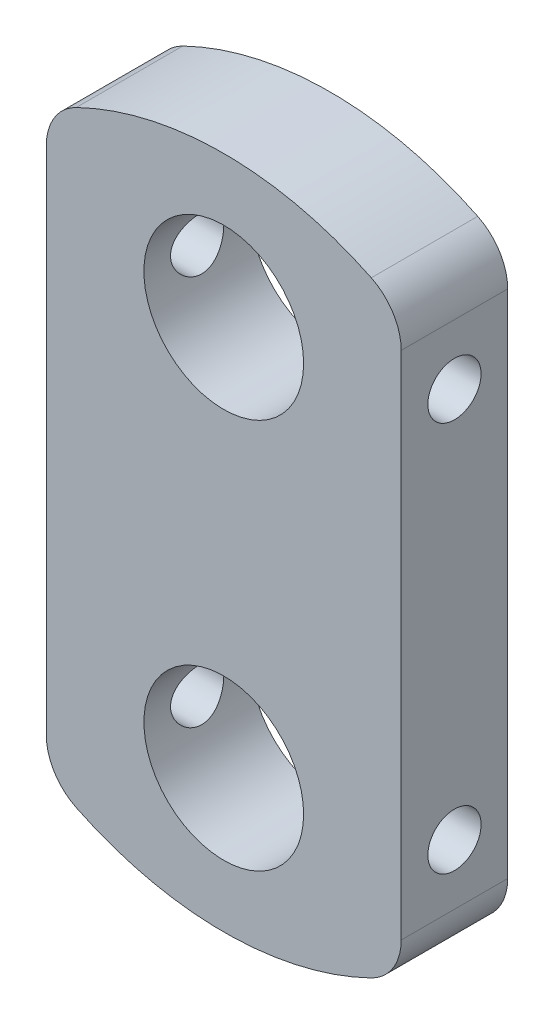
ISO-10303-21;
HEADER;
FILE_DESCRIPTION(('STEP AP214'),'2;1');
FILE_NAME('part.step','',(''),(''),'','','');
FILE_SCHEMA(('AUTOMOTIVE_DESIGN { 1 0 10303 214 1 1 1 1 }'));
ENDSEC;
DATA;
#1=APPLICATION_CONTEXT('core data for automotive mechanical design processes');
#2=APPLICATION_PROTOCOL_DEFINITION('international standard','automotive_design',2000,#1);
#3=PRODUCT_CONTEXT('',#1,'mechanical');
#4=PRODUCT('Part','Part','',(#3));
#5=PRODUCT_RELATED_PRODUCT_CATEGORY('part','',(#4));
#6=PRODUCT_DEFINITION_FORMATION('','',#4);
#7=PRODUCT_DEFINITION_CONTEXT('part definition',#1,'design');
#8=PRODUCT_DEFINITION('design','',#6,#7);
#9=PRODUCT_DEFINITION_SHAPE('','',#8);
#10=(LENGTH_UNIT() NAMED_UNIT(*) SI_UNIT(.MILLI.,.METRE.));
#11=(NAMED_UNIT(*) PLANE_ANGLE_UNIT() SI_UNIT($,.RADIAN.));
#12=(NAMED_UNIT(*) SI_UNIT($,.STERADIAN.) SOLID_ANGLE_UNIT());
#13=UNCERTAINTY_MEASURE_WITH_UNIT(LENGTH_MEASURE(1.E-05),#10,'distance_accuracy_value','');
#14=(GEOMETRIC_REPRESENTATION_CONTEXT(3) GLOBAL_UNCERTAINTY_ASSIGNED_CONTEXT((#13)) GLOBAL_UNIT_ASSIGNED_CONTEXT((#10,
#11,#12)) REPRESENTATION_CONTEXT('',''));
#15=CARTESIAN_POINT('',(0.,0.,0.));
#16=DIRECTION('',(0.,0.,1.));
#17=DIRECTION('',(1.,0.,0.));
#18=AXIS2_PLACEMENT_3D('',#15,#16,#17);
#19=CARTESIAN_POINT('',(0.,0.,6.));
#20=DIRECTION('',(0.,0.,-1.));
#21=DIRECTION('',(-1.,0.,0.));
#22=AXIS2_PLACEMENT_3D('',#19,#20,#21);
#23=CYLINDRICAL_SURFACE('',#22,19.);
#24=CARTESIAN_POINT('',(0.,0.,0.));
#25=DIRECTION('',(0.,0.,1.));
#26=DIRECTION('',(1.,0.,0.));
#27=AXIS2_PLACEMENT_3D('',#24,#25,#26);
#28=CIRCLE('',#27,19.);
#29=CARTESIAN_POINT('',(8.3125,17.0851498018016,0.));
#30=VERTEX_POINT('',#29);
#31=CARTESIAN_POINT('',(-8.3125,17.0851498018016,0.));
#32=VERTEX_POINT('',#31);
#33=EDGE_CURVE('E152',#30,#32,#28,.T.);
#34=ORIENTED_EDGE('',*,*,#33,.T.);
#35=DIRECTION('',(0.,0.,-1.));
#36=VECTOR('',#35,1.);
#37=CARTESIAN_POINT('',(-8.3125,17.0851498018016,6.));
#38=LINE('',#37,#36);
#39=CARTESIAN_POINT('',(-8.3125,17.0851498018016,6.));
#40=VERTEX_POINT('',#39);
#41=EDGE_CURVE('E11',#40,#32,#38,.T.);
#42=ORIENTED_EDGE('',*,*,#41,.F.);
#43=CARTESIAN_POINT('',(0.,0.,6.));
#44=DIRECTION('',(0.,0.,1.));
#45=DIRECTION('',(1.,0.,0.));
#46=AXIS2_PLACEMENT_3D('',#43,#44,#45);
#47=CIRCLE('',#46,19.);
#48=CARTESIAN_POINT('',(8.3125,17.0851498018016,6.));
#49=VERTEX_POINT('',#48);
#50=EDGE_CURVE('E175',#49,#40,#47,.T.);
#51=ORIENTED_EDGE('',*,*,#50,.F.);
#52=DIRECTION('',(0.,0.,-1.));
#53=VECTOR('',#52,1.);
#54=CARTESIAN_POINT('',(8.3125,17.0851498018016,6.));
#55=LINE('',#54,#53);
#56=EDGE_CURVE('E151',#49,#30,#55,.T.);
#57=ORIENTED_EDGE('',*,*,#56,.T.);
#58=EDGE_LOOP('',(#34,#42,#51,#57));
#59=FACE_BOUND('',#58,.T.);
#60=ADVANCED_FACE('F42',(#59),#23,.T.);
#61=CARTESIAN_POINT('',(-7.,14.3874945699382,6.));
#62=DIRECTION('',(0.,0.,-1.));
#63=DIRECTION('',(-1.,0.,0.));
#64=AXIS2_PLACEMENT_3D('',#61,#62,#63);
#65=CYLINDRICAL_SURFACE('',#64,3.);
#66=CARTESIAN_POINT('',(-7.,14.3874945699382,0.));
#67=DIRECTION('',(0.,0.,1.));
#68=DIRECTION('',(1.,0.,0.));
#69=AXIS2_PLACEMENT_3D('',#66,#67,#68);
#70=CIRCLE('',#69,3.);
#71=CARTESIAN_POINT('',(-10.,14.3874945699382,0.));
#72=VERTEX_POINT('',#71);
#73=EDGE_CURVE('E155',#32,#72,#70,.T.);
#74=ORIENTED_EDGE('',*,*,#73,.T.);
#75=DIRECTION('',(0.,0.,-1.));
#76=VECTOR('',#75,1.);
#77=CARTESIAN_POINT('',(-10.,14.3874945699382,6.));
#78=LINE('',#77,#76);
#79=CARTESIAN_POINT('',(-10.,14.3874945699382,6.));
#80=VERTEX_POINT('',#79);
#81=EDGE_CURVE('E56',#80,#72,#78,.T.);
#82=ORIENTED_EDGE('',*,*,#81,.F.);
#83=CARTESIAN_POINT('',(-7.,14.3874945699382,6.));
#84=DIRECTION('',(0.,0.,1.));
#85=DIRECTION('',(1.,0.,0.));
#86=AXIS2_PLACEMENT_3D('',#83,#84,#85);
#87=CIRCLE('',#86,3.);
#88=EDGE_CURVE('E108',#40,#80,#87,.T.);
#89=ORIENTED_EDGE('',*,*,#88,.F.);
#90=ORIENTED_EDGE('',*,*,#41,.T.);
#91=EDGE_LOOP('',(#74,#82,#89,#90));
#92=FACE_BOUND('',#91,.T.);
#93=ADVANCED_FACE('F220',(#92),#65,.T.);
#94=CARTESIAN_POINT('',(-10.,0.,6.));
#95=DIRECTION('',(-1.,0.,0.));
#96=DIRECTION('',(0.,0.,1.));
#97=AXIS2_PLACEMENT_3D('',#94,#95,#96);
#98=PLANE('',#97);
#99=CARTESIAN_POINT('',(-10.,11.,3.));
#100=DIRECTION('',(1.,0.,0.));
#101=DIRECTION('',(0.,0.,-1.));
#102=AXIS2_PLACEMENT_3D('',#99,#100,#101);
#103=CIRCLE('',#102,1.5);
#104=CARTESIAN_POINT('',(-10.,11.,1.5));
#105=VERTEX_POINT('',#104);
#106=EDGE_CURVE('E194',#105,#105,#103,.T.);
#107=ORIENTED_EDGE('',*,*,#106,.T.);
#108=EDGE_LOOP('',(#107));
#109=FACE_BOUND('',#108,.T.);
#110=CARTESIAN_POINT('',(-10.,-11.,3.));
#111=DIRECTION('',(1.,0.,0.));
#112=DIRECTION('',(0.,0.,-1.));
#113=AXIS2_PLACEMENT_3D('',#110,#111,#112);
#114=CIRCLE('',#113,1.5);
#115=CARTESIAN_POINT('',(-10.,-11.,1.5));
#116=VERTEX_POINT('',#115);
#117=EDGE_CURVE('E247',#116,#116,#114,.T.);
#118=ORIENTED_EDGE('',*,*,#117,.T.);
#119=EDGE_LOOP('',(#118));
#120=FACE_BOUND('',#119,.T.);
#121=DIRECTION('',(0.,1.,0.));
#122=VECTOR('',#121,1.);
#123=CARTESIAN_POINT('',(-10.,0.,0.));
#124=LINE('',#123,#122);
#125=CARTESIAN_POINT('',(-10.,-14.3874945699382,0.));
#126=VERTEX_POINT('',#125);
#127=EDGE_CURVE('E159',#126,#72,#124,.T.);
#128=ORIENTED_EDGE('',*,*,#127,.F.);
#129=DIRECTION('',(0.,0.,-1.));
#130=VECTOR('',#129,1.);
#131=CARTESIAN_POINT('',(-10.,-14.3874945699382,6.));
#132=LINE('',#131,#130);
#133=CARTESIAN_POINT('',(-10.,-14.3874945699382,6.));
#134=VERTEX_POINT('',#133);
#135=EDGE_CURVE('E182',#134,#126,#132,.T.);
#136=ORIENTED_EDGE('',*,*,#135,.F.);
#137=DIRECTION('',(0.,1.,0.));
#138=VECTOR('',#137,1.);
#139=CARTESIAN_POINT('',(-10.,0.,6.));
#140=LINE('',#139,#138);
#141=EDGE_CURVE('E233',#134,#80,#140,.T.);
#142=ORIENTED_EDGE('',*,*,#141,.T.);
#143=ORIENTED_EDGE('',*,*,#81,.T.);
#144=EDGE_LOOP('',(#128,#136,#142,#143));
#145=FACE_BOUND('',#144,.T.);
#146=ADVANCED_FACE('F225',(#109,#120,#145),#98,.T.);
#147=CARTESIAN_POINT('',(-7.,-14.3874945699382,6.));
#148=DIRECTION('',(0.,0.,-1.));
#149=DIRECTION('',(-1.,0.,0.));
#150=AXIS2_PLACEMENT_3D('',#147,#148,#149);
#151=CYLINDRICAL_SURFACE('',#150,3.);
#152=CARTESIAN_POINT('',(-7.,-14.3874945699382,0.));
#153=DIRECTION('',(0.,0.,1.));
#154=DIRECTION('',(1.,0.,0.));
#155=AXIS2_PLACEMENT_3D('',#152,#153,#154);
#156=CIRCLE('',#155,3.);
#157=CARTESIAN_POINT('',(-8.3125,-17.0851498018016,0.));
#158=VERTEX_POINT('',#157);
#159=EDGE_CURVE('E162',#126,#158,#156,.T.);
#160=ORIENTED_EDGE('',*,*,#159,.T.);
#161=DIRECTION('',(0.,0.,-1.));
#162=VECTOR('',#161,1.);
#163=CARTESIAN_POINT('',(-8.3125,-17.0851498018016,6.));
#164=LINE('',#163,#162);
#165=CARTESIAN_POINT('',(-8.3125,-17.0851498018016,6.));
#166=VERTEX_POINT('',#165);
#167=EDGE_CURVE('E179',#166,#158,#164,.T.);
#168=ORIENTED_EDGE('',*,*,#167,.F.);
#169=CARTESIAN_POINT('',(-7.,-14.3874945699382,6.));
#170=DIRECTION('',(0.,0.,1.));
#171=DIRECTION('',(1.,0.,0.));
#172=AXIS2_PLACEMENT_3D('',#169,#170,#171);
#173=CIRCLE('',#172,3.);
#174=EDGE_CURVE('E235',#134,#166,#173,.T.);
#175=ORIENTED_EDGE('',*,*,#174,.F.);
#176=ORIENTED_EDGE('',*,*,#135,.T.);
#177=EDGE_LOOP('',(#160,#168,#175,#176));
#178=FACE_BOUND('',#177,.T.);
#179=ADVANCED_FACE('F286',(#178),#151,.T.);
#180=CARTESIAN_POINT('',(0.,0.,6.));
#181=DIRECTION('',(0.,0.,-1.));
#182=DIRECTION('',(-1.,0.,0.));
#183=AXIS2_PLACEMENT_3D('',#180,#181,#182);
#184=CYLINDRICAL_SURFACE('',#183,19.);
#185=CARTESIAN_POINT('',(0.,0.,0.));
#186=DIRECTION('',(0.,0.,1.));
#187=DIRECTION('',(1.,0.,0.));
#188=AXIS2_PLACEMENT_3D('',#185,#186,#187);
#189=CIRCLE('',#188,19.);
#190=CARTESIAN_POINT('',(8.3125,-17.0851498018016,0.));
#191=VERTEX_POINT('',#190);
#192=EDGE_CURVE('E164',#158,#191,#189,.T.);
#193=ORIENTED_EDGE('',*,*,#192,.T.);
#194=DIRECTION('',(0.,0.,-1.));
#195=VECTOR('',#194,1.);
#196=CARTESIAN_POINT('',(8.3125,-17.0851498018016,6.));
#197=LINE('',#196,#195);
#198=CARTESIAN_POINT('',(8.3125,-17.0851498018016,6.));
#199=VERTEX_POINT('',#198);
#200=EDGE_CURVE('E137',#199,#191,#197,.T.);
#201=ORIENTED_EDGE('',*,*,#200,.F.);
#202=CARTESIAN_POINT('',(0.,0.,6.));
#203=DIRECTION('',(0.,0.,1.));
#204=DIRECTION('',(1.,0.,0.));
#205=AXIS2_PLACEMENT_3D('',#202,#203,#204);
#206=CIRCLE('',#205,19.);
#207=EDGE_CURVE('E128',#166,#199,#206,.T.);
#208=ORIENTED_EDGE('',*,*,#207,.F.);
#209=ORIENTED_EDGE('',*,*,#167,.T.);
#210=EDGE_LOOP('',(#193,#201,#208,#209));
#211=FACE_BOUND('',#210,.T.);
#212=ADVANCED_FACE('F283',(#211),#184,.T.);
#213=CARTESIAN_POINT('',(7.,-14.3874945699382,6.));
#214=DIRECTION('',(0.,0.,-1.));
#215=DIRECTION('',(-1.,0.,0.));
#216=AXIS2_PLACEMENT_3D('',#213,#214,#215);
#217=CYLINDRICAL_SURFACE('',#216,3.);
#218=CARTESIAN_POINT('',(7.,-14.3874945699382,0.));
#219=DIRECTION('',(0.,0.,1.));
#220=DIRECTION('',(1.,0.,0.));
#221=AXIS2_PLACEMENT_3D('',#218,#219,#220);
#222=CIRCLE('',#221,3.);
#223=CARTESIAN_POINT('',(10.,-14.3874945699382,0.));
#224=VERTEX_POINT('',#223);
#225=EDGE_CURVE('E136',#191,#224,#222,.T.);
#226=ORIENTED_EDGE('',*,*,#225,.T.);
#227=DIRECTION('',(0.,0.,-1.));
#228=VECTOR('',#227,1.);
#229=CARTESIAN_POINT('',(10.,-14.3874945699382,6.));
#230=LINE('',#229,#228);
#231=CARTESIAN_POINT('',(10.,-14.3874945699382,6.));
#232=VERTEX_POINT('',#231);
#233=EDGE_CURVE('E133',#232,#224,#230,.T.);
#234=ORIENTED_EDGE('',*,*,#233,.F.);
#235=CARTESIAN_POINT('',(7.,-14.3874945699382,6.));
#236=DIRECTION('',(0.,0.,1.));
#237=DIRECTION('',(1.,0.,0.));
#238=AXIS2_PLACEMENT_3D('',#235,#236,#237);
#239=CIRCLE('',#238,3.);
#240=EDGE_CURVE('E121',#199,#232,#239,.T.);
#241=ORIENTED_EDGE('',*,*,#240,.F.);
#242=ORIENTED_EDGE('',*,*,#200,.T.);
#243=EDGE_LOOP('',(#226,#234,#241,#242));
#244=FACE_BOUND('',#243,.T.);
#245=ADVANCED_FACE('F134',(#244),#217,.T.);
#246=CARTESIAN_POINT('',(10.,0.,6.));
#247=DIRECTION('',(-1.,0.,0.));
#248=DIRECTION('',(0.,0.,1.));
#249=AXIS2_PLACEMENT_3D('',#246,#247,#248);
#250=PLANE('',#249);
#251=CARTESIAN_POINT('',(10.,11.,3.));
#252=DIRECTION('',(-1.,0.,0.));
#253=DIRECTION('',(0.,0.,1.));
#254=AXIS2_PLACEMENT_3D('',#251,#252,#253);
#255=CIRCLE('',#254,1.5);
#256=CARTESIAN_POINT('',(10.,11.,4.5));
#257=VERTEX_POINT('',#256);
#258=EDGE_CURVE('E156',#257,#257,#255,.T.);
#259=ORIENTED_EDGE('',*,*,#258,.T.);
#260=EDGE_LOOP('',(#259));
#261=FACE_BOUND('',#260,.T.);
#262=CARTESIAN_POINT('',(10.,-11.,3.));
#263=DIRECTION('',(-1.,0.,0.));
#264=DIRECTION('',(0.,0.,1.));
#265=AXIS2_PLACEMENT_3D('',#262,#263,#264);
#266=CIRCLE('',#265,1.5);
#267=CARTESIAN_POINT('',(10.,-11.,4.5));
#268=VERTEX_POINT('',#267);
#269=EDGE_CURVE('E243',#268,#268,#266,.T.);
#270=ORIENTED_EDGE('',*,*,#269,.T.);
#271=EDGE_LOOP('',(#270));
#272=FACE_BOUND('',#271,.T.);
#273=DIRECTION('',(0.,1.,0.));
#274=VECTOR('',#273,1.);
#275=CARTESIAN_POINT('',(10.,0.,0.));
#276=LINE('',#275,#274);
#277=CARTESIAN_POINT('',(10.,14.3874945699382,0.));
#278=VERTEX_POINT('',#277);
#279=EDGE_CURVE('E94',#224,#278,#276,.T.);
#280=ORIENTED_EDGE('',*,*,#279,.T.);
#281=DIRECTION('',(0.,0.,-1.));
#282=VECTOR('',#281,1.);
#283=CARTESIAN_POINT('',(10.,14.3874945699382,6.));
#284=LINE('',#283,#282);
#285=CARTESIAN_POINT('',(10.,14.3874945699382,6.));
#286=VERTEX_POINT('',#285);
#287=EDGE_CURVE('E138',#286,#278,#284,.T.);
#288=ORIENTED_EDGE('',*,*,#287,.F.);
#289=DIRECTION('',(0.,1.,0.));
#290=VECTOR('',#289,1.);
#291=CARTESIAN_POINT('',(10.,0.,6.));
#292=LINE('',#291,#290);
#293=EDGE_CURVE('E126',#232,#286,#292,.T.);
#294=ORIENTED_EDGE('',*,*,#293,.F.);
#295=ORIENTED_EDGE('',*,*,#233,.T.);
#296=EDGE_LOOP('',(#280,#288,#294,#295));
#297=FACE_BOUND('',#296,.T.);
#298=ADVANCED_FACE('F140',(#261,#272,#297),#250,.F.);
#299=CARTESIAN_POINT('',(0.,11.,6.));
#300=DIRECTION('',(0.,0.,-1.));
#301=DIRECTION('',(-1.,0.,0.));
#302=AXIS2_PLACEMENT_3D('',#299,#300,#301);
#303=CYLINDRICAL_SURFACE('',#302,4.5);
#304=CARTESIAN_POINT('',(-4.5,11.,4.5));
#305=CARTESIAN_POINT('',(-4.50000022951416,10.9181549556699,4.50000038059746));
#306=CARTESIAN_POINT('',(-4.49774654261317,10.8363122081922,4.49327960080917));
#307=CARTESIAN_POINT('',(-4.48897815304921,10.6750373586905,4.46665633677417));
#308=CARTESIAN_POINT('',(-4.48246300803229,10.5956055078218,4.44675248407662));
#309=CARTESIAN_POINT('',(-4.46587961859664,10.4415008157473,4.39452113492393));
#310=CARTESIAN_POINT('',(-4.4558173159628,10.366820261171,4.36221440631109));
#311=CARTESIAN_POINT('',(-4.43316668576013,10.223937594792,4.28618824074248));
#312=CARTESIAN_POINT('',(-4.42057786001667,10.1557367645619,4.2424665524961));
#313=CARTESIAN_POINT('',(-4.39371141664507,10.0253874874666,4.14326129271187));
#314=CARTESIAN_POINT('',(-4.37939334695677,9.96349444955254,4.08745314860926));
#315=CARTESIAN_POINT('',(-4.35090472174682,9.84975096094687,3.96634926794015));
#316=CARTESIAN_POINT('',(-4.33673419935824,9.79790272176581,3.90105144760723));
#317=CARTESIAN_POINT('',(-4.30969998715911,9.70426258665821,3.76052232720531));
#318=CARTESIAN_POINT('',(-4.29688558913532,9.66280271266845,3.68505939040182));
#319=CARTESIAN_POINT('',(-4.27462958127902,9.59327168918342,3.52773585831218));
#320=CARTESIAN_POINT('',(-4.26518694241118,9.56519645391985,3.44587722425589));
#321=CARTESIAN_POINT('',(-4.25116954904066,9.52418980773625,3.28099016775494));
#322=CARTESIAN_POINT('',(-4.24644143654417,9.51077982759235,3.1980941872664));
#323=CARTESIAN_POINT('',(-4.24193484944261,9.49798831499828,3.03110436876618));
#324=CARTESIAN_POINT('',(-4.24215484534095,9.49860244759292,2.94701090893622));
#325=CARTESIAN_POINT('',(-4.2473852251227,9.51347014444487,2.78409505433397));
#326=CARTESIAN_POINT('',(-4.25217623801299,9.52709913024951,2.70520739562147));
#327=CARTESIAN_POINT('',(-4.26564986586826,9.56659075572587,2.55090987058975));
#328=CARTESIAN_POINT('',(-4.27433294676161,9.59245486011219,2.4755004218474));
#329=CARTESIAN_POINT('',(-4.29476866696873,9.65609141290968,2.32888087561278));
#330=CARTESIAN_POINT('',(-4.30656848689676,9.69404892693911,2.25775796179571));
#331=CARTESIAN_POINT('',(-4.3318883786359,9.78066634054529,2.12269363758041));
#332=CARTESIAN_POINT('',(-4.34540894685695,9.82932933145399,2.05875430959993));
#333=CARTESIAN_POINT('',(-4.37350993751611,9.93897600097664,1.93636260275884));
#334=CARTESIAN_POINT('',(-4.38810884032264,10.0004702748855,1.8783709582364));
#335=CARTESIAN_POINT('',(-4.41610407580555,10.1324906450449,1.7734031000049));
#336=CARTESIAN_POINT('',(-4.42950029307101,10.2030176065088,1.72642794275326));
#337=CARTESIAN_POINT('',(-4.4537566190669,10.3520785804306,1.6444555496474));
#338=CARTESIAN_POINT('',(-4.46459025012059,10.4306850853755,1.6095817629889));
#339=CARTESIAN_POINT('',(-4.48230850716652,10.5930963749532,1.55369523906643));
#340=CARTESIAN_POINT('',(-4.48919450482319,10.6768993427676,1.53267768686484));
#341=CARTESIAN_POINT('',(-4.49801440607161,10.843424255706,1.50591650096646));
#342=CARTESIAN_POINT('',(-4.50015002750592,10.9260356002027,1.49955028624087));
#343=CARTESIAN_POINT('',(-4.49983354042241,11.0911626049404,1.5004990103977));
#344=CARTESIAN_POINT('',(-4.49738220629043,11.1736782789795,1.50781163996981));
#345=CARTESIAN_POINT('',(-4.48830037075656,11.3337797994564,1.53541786160394));
#346=CARTESIAN_POINT('',(-4.48179298066788,11.4114392102523,1.55532930907424));
#347=CARTESIAN_POINT('',(-4.46537770245105,11.5622839378694,1.60709016670009));
#348=CARTESIAN_POINT('',(-4.45546938070013,11.6354686827629,1.63894109920168));
#349=CARTESIAN_POINT('',(-4.43293396930935,11.7774324445899,1.71460564776118));
#350=CARTESIAN_POINT('',(-4.42024222133679,11.8460449388257,1.75871188992476));
#351=CARTESIAN_POINT('',(-4.39357880874394,11.9750972452034,1.85729122502022));
#352=CARTESIAN_POINT('',(-4.37960675390741,12.0355345516934,1.91176748404765));
#353=CARTESIAN_POINT('',(-4.35115271970667,12.1493787617094,2.03246812650988));
#354=CARTESIAN_POINT('',(-4.33667641631142,12.2023414538687,2.09911384039029));
#355=CARTESIAN_POINT('',(-4.30949959942063,12.2963862834854,2.24065735171633));
#356=CARTESIAN_POINT('',(-4.29679910073003,12.3374683218965,2.31555521795111));
#357=CARTESIAN_POINT('',(-4.27473587687075,12.4063953956245,2.47150952293484));
#358=CARTESIAN_POINT('',(-4.26536641189468,12.4342671982475,2.55255311875315));
#359=CARTESIAN_POINT('',(-4.25116248459674,12.475842000139,2.71856797506619));
#360=CARTESIAN_POINT('',(-4.24632597935459,12.4895513824309,2.80353744810652));
#361=CARTESIAN_POINT('',(-4.24196788311266,12.501914423716,2.97029564406137));
#362=CARTESIAN_POINT('',(-4.24218600386123,12.5013053859626,3.05202351043023));
#363=CARTESIAN_POINT('',(-4.24726904735801,12.486863440173,3.21414761238309));
#364=CARTESIAN_POINT('',(-4.25213369354042,12.4730313191879,3.29454392693263));
#365=CARTESIAN_POINT('',(-4.26576786457337,12.433057719694,3.45020349450371));
#366=CARTESIAN_POINT('',(-4.27446147033716,12.4071550190233,3.52553523750674));
#367=CARTESIAN_POINT('',(-4.29474598227703,12.3439690486396,3.6708411104074));
#368=CARTESIAN_POINT('',(-4.3063375314509,12.3066832528307,3.74081404678201));
#369=CARTESIAN_POINT('',(-4.33174243839069,12.2198910388751,3.87672550488437));
#370=CARTESIAN_POINT('',(-4.34563067463206,12.1699223641469,3.94235475284758));
#371=CARTESIAN_POINT('',(-4.37375034424879,12.0599643247035,4.0645347200763));
#372=CARTESIAN_POINT('',(-4.38798187368558,11.9999721266772,4.12108286353211));
#373=CARTESIAN_POINT('',(-4.41585045788316,11.868862335381,4.22571661843377));
#374=CARTESIAN_POINT('',(-4.42944272701885,11.7974022702496,4.2733865216265));
#375=CARTESIAN_POINT('',(-4.45388986758918,11.6470360361099,4.35598564327597));
#376=CARTESIAN_POINT('',(-4.46474543861895,11.5681317771985,4.39091811888306));
#377=CARTESIAN_POINT('',(-4.48208272602813,11.4087404708015,4.44558244873301));
#378=CARTESIAN_POINT('',(-4.48873818633784,11.3284816365146,4.46592369939506));
#379=CARTESIAN_POINT('',(-4.49769610596333,11.1654806240154,4.49313042101569));
#380=CARTESIAN_POINT('',(-4.49999976797857,11.0827391383531,4.49999961524481));
#381=CARTESIAN_POINT('',(-4.5,11.,4.5));
#382=B_SPLINE_CURVE_WITH_KNOTS('',3,(#304,#305,#306,#307,#308,#309,#310,#311,#312,#313,#314,
#315,#316,#317,#318,#319,#320,#321,#322,#323,#324,#325,#326,#327,#328,#329,#330,#331,#332,#333,
#334,#335,#336,#337,#338,#339,#340,#341,#342,#343,#344,#345,#346,#347,#348,#349,#350,#351,#352,
#353,#354,#355,#356,#357,#358,#359,#360,#361,#362,#363,#364,#365,#366,#367,#368,#369,#370,#371,
#372,#373,#374,#375,#376,#377,#378,#379,#380,#381),.UNSPECIFIED.,.T.,.F.,(4,2,2,2,2,2,2,2,2,2,2,
2,2,2,2,2,2,2,2,2,2,2,2,2,2,2,2,2,2,2,2,2,2,2,2,2,2,2,4),(0.,0.245230659039017,0.49048677790128,
0.73533400930541,0.980229566698647,1.23277026424134,1.48536649931295,1.74522577235205,
2.0050056703925,2.2560288861276,2.50697450981228,2.7464523982692,2.98595896283223,
3.22932256732696,3.47275653837311,3.7288995871705,3.98506718949927,4.24377608475536,
4.50239503315812,4.74980374762754,4.99717069746265,5.2373723696732,5.47760467926156,
5.72415599765605,5.97078271232837,6.22861534321128,6.48645012352495,6.74376020740156,
7.0009542705876,7.24493499096387,7.48890119027063,7.72823380620626,7.96761957263966,
8.21745100037707,8.46735316685668,8.72699491252651,8.98657021728684,9.2345483756072,
9.4824579905721),.UNSPECIFIED.);
#383=CARTESIAN_POINT('',(-4.5,11.,4.5));
#384=VERTEX_POINT('',#383);
#385=EDGE_CURVE('E45',#384,#384,#382,.T.);
#386=ORIENTED_EDGE('',*,*,#385,.F.);
#387=EDGE_LOOP('',(#386));
#388=FACE_BOUND('',#387,.T.);
#389=CARTESIAN_POINT('',(4.5,11.,1.5));
#390=CARTESIAN_POINT('',(4.50000022951416,10.9181549556699,1.49999961940254));
#391=CARTESIAN_POINT('',(4.49774654261317,10.8363122081922,1.50672039919083));
#392=CARTESIAN_POINT('',(4.48897815304921,10.6750373586905,1.53334366322583));
#393=CARTESIAN_POINT('',(4.48246300803229,10.5956055078218,1.55324751592338));
#394=CARTESIAN_POINT('',(4.46587961859664,10.4415008157473,1.60547886507607));
#395=CARTESIAN_POINT('',(4.4558173159628,10.3668202611709,1.63778559368891));
#396=CARTESIAN_POINT('',(4.43316668576013,10.223937594792,1.71381175925752));
#397=CARTESIAN_POINT('',(4.42057786001667,10.1557367645619,1.7575334475039));
#398=CARTESIAN_POINT('',(4.39371141664508,10.0253874874666,1.85673870728813));
#399=CARTESIAN_POINT('',(4.37939334695677,9.96349444955254,1.91254685139074));
#400=CARTESIAN_POINT('',(4.35090472174682,9.84975096094687,2.03365073205985));
#401=CARTESIAN_POINT('',(4.33673419935824,9.79790272176581,2.09894855239277));
#402=CARTESIAN_POINT('',(4.30969998715911,9.70426258665821,2.23947767279469));
#403=CARTESIAN_POINT('',(4.29688558913532,9.66280271266845,2.31494060959818));
#404=CARTESIAN_POINT('',(4.27462958127902,9.59327168918342,2.47226414168782));
#405=CARTESIAN_POINT('',(4.26518694241118,9.56519645391985,2.55412277574411));
#406=CARTESIAN_POINT('',(4.25116954904066,9.52418980773625,2.71900983224506));
#407=CARTESIAN_POINT('',(4.24644143654417,9.51077982759235,2.8019058127336));
#408=CARTESIAN_POINT('',(4.24193484944261,9.49798831499828,2.96889563123382));
#409=CARTESIAN_POINT('',(4.24215484534095,9.49860244759292,3.05298909106378));
#410=CARTESIAN_POINT('',(4.2473852251227,9.51347014444487,3.21590494566603));
#411=CARTESIAN_POINT('',(4.25217623801299,9.52709913024951,3.29479260437853));
#412=CARTESIAN_POINT('',(4.26564986586826,9.56659075572587,3.44909012941025));
#413=CARTESIAN_POINT('',(4.27433294676161,9.59245486011219,3.5244995781526));
#414=CARTESIAN_POINT('',(4.29476866696873,9.65609141290968,3.67111912438722));
#415=CARTESIAN_POINT('',(4.30656848689676,9.6940489269391,3.74224203820429));
#416=CARTESIAN_POINT('',(4.3318883786359,9.78066634054529,3.87730636241959));
#417=CARTESIAN_POINT('',(4.34540894685695,9.82932933145399,3.94124569040007));
#418=CARTESIAN_POINT('',(4.37350993751611,9.93897600097664,4.06363739724116));
#419=CARTESIAN_POINT('',(4.38810884032264,10.0004702748855,4.1216290417636));
#420=CARTESIAN_POINT('',(4.41610407580555,10.1324906450449,4.2265968999951));
#421=CARTESIAN_POINT('',(4.42950029307101,10.2030176065088,4.27357205724674));
#422=CARTESIAN_POINT('',(4.4537566190669,10.3520785804306,4.3555444503526));
#423=CARTESIAN_POINT('',(4.46459025012059,10.4306850853755,4.3904182370111));
#424=CARTESIAN_POINT('',(4.48230850716652,10.5930963749532,4.44630476093357));
#425=CARTESIAN_POINT('',(4.48919450482319,10.6768993427676,4.46732231313516));
#426=CARTESIAN_POINT('',(4.49801440607161,10.843424255706,4.49408349903354));
#427=CARTESIAN_POINT('',(4.50015002750592,10.9260356002027,4.50044971375913));
#428=CARTESIAN_POINT('',(4.49983354042241,11.0911626049404,4.4995009896023));
#429=CARTESIAN_POINT('',(4.49738220629043,11.1736782789795,4.49218836003019));
#430=CARTESIAN_POINT('',(4.48830037075656,11.3337797994564,4.46458213839606));
#431=CARTESIAN_POINT('',(4.48179298066788,11.4114392102523,4.44467069092576));
#432=CARTESIAN_POINT('',(4.46537770245105,11.5622839378694,4.39290983329991));
#433=CARTESIAN_POINT('',(4.45546938070013,11.6354686827629,4.36105890079832));
#434=CARTESIAN_POINT('',(4.43293396930935,11.7774324445899,4.28539435223882));
#435=CARTESIAN_POINT('',(4.42024222133679,11.8460449388257,4.24128811007524));
#436=CARTESIAN_POINT('',(4.39357880874394,11.9750972452034,4.14270877497978));
#437=CARTESIAN_POINT('',(4.37960675390741,12.0355345516934,4.08823251595235));
#438=CARTESIAN_POINT('',(4.35115271970667,12.1493787617094,3.96753187349012));
#439=CARTESIAN_POINT('',(4.33667641631142,12.2023414538687,3.90088615960971));
#440=CARTESIAN_POINT('',(4.30949959942063,12.2963862834854,3.75934264828367));
#441=CARTESIAN_POINT('',(4.29679910073003,12.3374683218965,3.68444478204889));
#442=CARTESIAN_POINT('',(4.27473587687075,12.4063953956245,3.52849047706516));
#443=CARTESIAN_POINT('',(4.26536641189468,12.4342671982475,3.44744688124685));
#444=CARTESIAN_POINT('',(4.25116248459674,12.475842000139,3.28143202493381));
#445=CARTESIAN_POINT('',(4.24632597935459,12.4895513824309,3.19646255189348));
#446=CARTESIAN_POINT('',(4.24196788311266,12.501914423716,3.02970435593863));
#447=CARTESIAN_POINT('',(4.24218600386123,12.5013053859626,2.94797648956977));
#448=CARTESIAN_POINT('',(4.24726904735801,12.486863440173,2.78585238761691));
#449=CARTESIAN_POINT('',(4.25213369354042,12.4730313191879,2.70545607306737));
#450=CARTESIAN_POINT('',(4.26576786457337,12.433057719694,2.54979650549629));
#451=CARTESIAN_POINT('',(4.27446147033716,12.4071550190233,2.47446476249326));
#452=CARTESIAN_POINT('',(4.29474598227703,12.3439690486396,2.3291588895926));
#453=CARTESIAN_POINT('',(4.3063375314509,12.3066832528307,2.25918595321799));
#454=CARTESIAN_POINT('',(4.33174243839069,12.2198910388751,2.12327449511563));
#455=CARTESIAN_POINT('',(4.34563067463205,12.1699223641469,2.05764524715242));
#456=CARTESIAN_POINT('',(4.37375034424879,12.0599643247035,1.9354652799237));
#457=CARTESIAN_POINT('',(4.38798187368558,11.9999721266772,1.87891713646789));
#458=CARTESIAN_POINT('',(4.41585045788316,11.868862335381,1.77428338156623));
#459=CARTESIAN_POINT('',(4.42944272701885,11.7974022702496,1.7266134783735));
#460=CARTESIAN_POINT('',(4.45388986758918,11.6470360361099,1.64401435672403));
#461=CARTESIAN_POINT('',(4.46474543861895,11.5681317771985,1.60908188111694));
#462=CARTESIAN_POINT('',(4.48208272602813,11.4087404708015,1.55441755126699));
#463=CARTESIAN_POINT('',(4.48873818633784,11.3284816365146,1.53407630060494));
#464=CARTESIAN_POINT('',(4.49769610596333,11.1654806240154,1.50686957898431));
#465=CARTESIAN_POINT('',(4.49999976797857,11.0827391383531,1.50000038475519));
#466=CARTESIAN_POINT('',(4.5,11.,1.5));
#467=B_SPLINE_CURVE_WITH_KNOTS('',3,(#389,#390,#391,#392,#393,#394,#395,#396,#397,#398,#399,
#400,#401,#402,#403,#404,#405,#406,#407,#408,#409,#410,#411,#412,#413,#414,#415,#416,#417,#418,
#419,#420,#421,#422,#423,#424,#425,#426,#427,#428,#429,#430,#431,#432,#433,#434,#435,#436,#437,
#438,#439,#440,#441,#442,#443,#444,#445,#446,#447,#448,#449,#450,#451,#452,#453,#454,#455,#456,
#457,#458,#459,#460,#461,#462,#463,#464,#465,#466),.UNSPECIFIED.,.T.,.F.,(4,2,2,2,2,2,2,2,2,2,2,
2,2,2,2,2,2,2,2,2,2,2,2,2,2,2,2,2,2,2,2,2,2,2,2,2,2,2,4),(0.,0.245230659039017,0.49048677790128,
0.735334009305409,0.980229566698647,1.23277026424134,1.48536649931295,1.74522577235205,
2.0050056703925,2.2560288861276,2.50697450981228,2.7464523982692,2.98595896283223,
3.22932256732696,3.47275653837311,3.7288995871705,3.98506718949927,4.24377608475536,
4.50239503315812,4.74980374762754,4.99717069746265,5.2373723696732,5.47760467926156,
5.72415599765605,5.97078271232836,6.22861534321128,6.48645012352495,6.74376020740155,
7.0009542705876,7.24493499096387,7.48890119027063,7.72823380620626,7.96761957263966,
8.21745100037707,8.46735316685668,8.72699491252651,8.98657021728684,9.2345483756072,
9.4824579905721),.UNSPECIFIED.);
#468=CARTESIAN_POINT('',(4.5,11.,1.5));
#469=VERTEX_POINT('',#468);
#470=EDGE_CURVE('E246',#469,#469,#467,.T.);
#471=ORIENTED_EDGE('',*,*,#470,.F.);
#472=EDGE_LOOP('',(#471));
#473=FACE_BOUND('',#472,.T.);
#474=CARTESIAN_POINT('',(0.,11.,6.));
#475=DIRECTION('',(0.,0.,1.));
#476=DIRECTION('',(1.,0.,0.));
#477=AXIS2_PLACEMENT_3D('',#474,#475,#476);
#478=CIRCLE('',#477,4.5);
#479=CARTESIAN_POINT('',(4.5,11.,6.));
#480=VERTEX_POINT('',#479);
#481=EDGE_CURVE('E142',#480,#480,#478,.T.);
#482=ORIENTED_EDGE('',*,*,#481,.T.);
#483=EDGE_LOOP('',(#482));
#484=FACE_BOUND('',#483,.T.);
#485=CARTESIAN_POINT('',(0.,11.,0.));
#486=DIRECTION('',(0.,0.,1.));
#487=DIRECTION('',(1.,0.,0.));
#488=AXIS2_PLACEMENT_3D('',#485,#486,#487);
#489=CIRCLE('',#488,4.5);
#490=CARTESIAN_POINT('',(4.5,11.,0.));
#491=VERTEX_POINT('',#490);
#492=EDGE_CURVE('E169',#491,#491,#489,.T.);
#493=ORIENTED_EDGE('',*,*,#492,.F.);
#494=EDGE_LOOP('',(#493));
#495=FACE_BOUND('',#494,.T.);
#496=ADVANCED_FACE('F270',(#388,#473,#484,#495),#303,.F.);
#497=CARTESIAN_POINT('',(7.,14.3874945699382,6.));
#498=DIRECTION('',(0.,0.,-1.));
#499=DIRECTION('',(-1.,0.,0.));
#500=AXIS2_PLACEMENT_3D('',#497,#498,#499);
#501=CYLINDRICAL_SURFACE('',#500,3.);
#502=CARTESIAN_POINT('',(7.,14.3874945699382,0.));
#503=DIRECTION('',(0.,0.,1.));
#504=DIRECTION('',(1.,0.,0.));
#505=AXIS2_PLACEMENT_3D('',#502,#503,#504);
#506=CIRCLE('',#505,3.);
#507=EDGE_CURVE('E100',#278,#30,#506,.T.);
#508=ORIENTED_EDGE('',*,*,#507,.T.);
#509=ORIENTED_EDGE('',*,*,#56,.F.);
#510=CARTESIAN_POINT('',(7.,14.3874945699382,6.));
#511=DIRECTION('',(0.,0.,1.));
#512=DIRECTION('',(1.,0.,0.));
#513=AXIS2_PLACEMENT_3D('',#510,#511,#512);
#514=CIRCLE('',#513,3.);
#515=EDGE_CURVE('E65',#286,#49,#514,.T.);
#516=ORIENTED_EDGE('',*,*,#515,.F.);
#517=ORIENTED_EDGE('',*,*,#287,.T.);
#518=EDGE_LOOP('',(#508,#509,#516,#517));
#519=FACE_BOUND('',#518,.T.);
#520=ADVANCED_FACE('F274',(#519),#501,.T.);
#521=CARTESIAN_POINT('',(0.,-11.,6.));
#522=DIRECTION('',(0.,0.,-1.));
#523=DIRECTION('',(-1.,0.,0.));
#524=AXIS2_PLACEMENT_3D('',#521,#522,#523);
#525=CYLINDRICAL_SURFACE('',#524,4.5);
#526=CARTESIAN_POINT('',(-4.5,-11.,4.5));
#527=CARTESIAN_POINT('',(-4.50000022951416,-11.0818450443301,4.50000038059746));
#528=CARTESIAN_POINT('',(-4.49774654261317,-11.1636877918078,4.49327960080917));
#529=CARTESIAN_POINT('',(-4.48897815304921,-11.3249626413095,4.46665633677417));
#530=CARTESIAN_POINT('',(-4.48246300803229,-11.4043944921782,4.44675248407662));
#531=CARTESIAN_POINT('',(-4.46587961859664,-11.5584991842527,4.39452113492393));
#532=CARTESIAN_POINT('',(-4.4558173159628,-11.633179738829,4.36221440631109));
#533=CARTESIAN_POINT('',(-4.43316668576013,-11.776062405208,4.28618824074248));
#534=CARTESIAN_POINT('',(-4.42057786001667,-11.8442632354381,4.2424665524961));
#535=CARTESIAN_POINT('',(-4.39371141664507,-11.9746125125334,4.14326129271187));
#536=CARTESIAN_POINT('',(-4.37939334695677,-12.0365055504475,4.08745314860926));
#537=CARTESIAN_POINT('',(-4.35090472174682,-12.1502490390531,3.96634926794015));
#538=CARTESIAN_POINT('',(-4.33673419935824,-12.2020972782342,3.90105144760723));
#539=CARTESIAN_POINT('',(-4.30969998715911,-12.2957374133418,3.76052232720531));
#540=CARTESIAN_POINT('',(-4.29688558913532,-12.3371972873315,3.68505939040182));
#541=CARTESIAN_POINT('',(-4.27462958127902,-12.4067283108166,3.52773585831218));
#542=CARTESIAN_POINT('',(-4.26518694241118,-12.4348035460801,3.44587722425589));
#543=CARTESIAN_POINT('',(-4.25116954904066,-12.4758101922637,3.28099016775494));
#544=CARTESIAN_POINT('',(-4.24644143654417,-12.4892201724077,3.1980941872664));
#545=CARTESIAN_POINT('',(-4.24193484944261,-12.5020116850017,3.03110436876618));
#546=CARTESIAN_POINT('',(-4.24215484534095,-12.5013975524071,2.94701090893622));
#547=CARTESIAN_POINT('',(-4.2473852251227,-12.4865298555551,2.78409505433397));
#548=CARTESIAN_POINT('',(-4.25217623801299,-12.4729008697505,2.70520739562147));
#549=CARTESIAN_POINT('',(-4.26564986586826,-12.4334092442741,2.55090987058975));
#550=CARTESIAN_POINT('',(-4.27433294676161,-12.4075451398878,2.4755004218474));
#551=CARTESIAN_POINT('',(-4.29476866696873,-12.3439085870903,2.32888087561278));
#552=CARTESIAN_POINT('',(-4.30656848689676,-12.3059510730609,2.25775796179571));
#553=CARTESIAN_POINT('',(-4.3318883786359,-12.2193336594547,2.12269363758041));
#554=CARTESIAN_POINT('',(-4.34540894685695,-12.170670668546,2.05875430959993));
#555=CARTESIAN_POINT('',(-4.37350993751611,-12.0610239990234,1.93636260275884));
#556=CARTESIAN_POINT('',(-4.38810884032264,-11.9995297251145,1.8783709582364));
#557=CARTESIAN_POINT('',(-4.41610407580555,-11.8675093549551,1.7734031000049));
#558=CARTESIAN_POINT('',(-4.42950029307101,-11.7969823934912,1.72642794275326));
#559=CARTESIAN_POINT('',(-4.4537566190669,-11.6479214195694,1.6444555496474));
#560=CARTESIAN_POINT('',(-4.46459025012059,-11.5693149146245,1.6095817629889));
#561=CARTESIAN_POINT('',(-4.48230850716652,-11.4069036250468,1.55369523906643));
#562=CARTESIAN_POINT('',(-4.48919450482319,-11.3231006572324,1.53267768686484));
#563=CARTESIAN_POINT('',(-4.49801440607161,-11.156575744294,1.50591650096646));
#564=CARTESIAN_POINT('',(-4.50015002750592,-11.0739643997973,1.49955028624087));
#565=CARTESIAN_POINT('',(-4.49983354042241,-10.9088373950596,1.5004990103977));
#566=CARTESIAN_POINT('',(-4.49738220629043,-10.8263217210205,1.50781163996981));
#567=CARTESIAN_POINT('',(-4.48830037075656,-10.6662202005436,1.53541786160394));
#568=CARTESIAN_POINT('',(-4.48179298066788,-10.5885607897477,1.55532930907424));
#569=CARTESIAN_POINT('',(-4.46537770245105,-10.4377160621306,1.60709016670009));
#570=CARTESIAN_POINT('',(-4.45546938070013,-10.3645313172371,1.63894109920168));
#571=CARTESIAN_POINT('',(-4.43293396930935,-10.2225675554101,1.71460564776118));
#572=CARTESIAN_POINT('',(-4.42024222133679,-10.1539550611743,1.75871188992476));
#573=CARTESIAN_POINT('',(-4.39357880874394,-10.0249027547966,1.85729122502022));
#574=CARTESIAN_POINT('',(-4.37960675390741,-9.96446544830664,1.91176748404765));
#575=CARTESIAN_POINT('',(-4.35115271970667,-9.85062123829055,2.03246812650988));
#576=CARTESIAN_POINT('',(-4.33667641631142,-9.79765854613134,2.09911384039029));
#577=CARTESIAN_POINT('',(-4.30949959942063,-9.70361371651464,2.24065735171633));
#578=CARTESIAN_POINT('',(-4.29679910073003,-9.66253167810348,2.31555521795111));
#579=CARTESIAN_POINT('',(-4.27473587687075,-9.59360460437546,2.47150952293484));
#580=CARTESIAN_POINT('',(-4.26536641189468,-9.56573280175247,2.55255311875315));
#581=CARTESIAN_POINT('',(-4.25116248459674,-9.52415799986097,2.71856797506619));
#582=CARTESIAN_POINT('',(-4.24632597935459,-9.51044861756909,2.80353744810652));
#583=CARTESIAN_POINT('',(-4.24196788311266,-9.49808557628399,2.97029564406137));
#584=CARTESIAN_POINT('',(-4.24218600386123,-9.4986946140374,3.05202351043023));
#585=CARTESIAN_POINT('',(-4.24726904735801,-9.51313655982696,3.21414761238309));
#586=CARTESIAN_POINT('',(-4.25213369354042,-9.52696868081212,3.29454392693263));
#587=CARTESIAN_POINT('',(-4.26576786457337,-9.56694228030598,3.45020349450371));
#588=CARTESIAN_POINT('',(-4.27446147033716,-9.59284498097673,3.52553523750674));
#589=CARTESIAN_POINT('',(-4.29474598227703,-9.65603095136038,3.6708411104074));
#590=CARTESIAN_POINT('',(-4.3063375314509,-9.69331674716929,3.74081404678201));
#591=CARTESIAN_POINT('',(-4.33174243839069,-9.78010896112485,3.87672550488437));
#592=CARTESIAN_POINT('',(-4.34563067463206,-9.83007763585313,3.94235475284758));
#593=CARTESIAN_POINT('',(-4.37375034424879,-9.94003567529652,4.0645347200763));
#594=CARTESIAN_POINT('',(-4.38798187368558,-10.0000278733228,4.12108286353211));
#595=CARTESIAN_POINT('',(-4.41585045788316,-10.131137664619,4.22571661843377));
#596=CARTESIAN_POINT('',(-4.42944272701885,-10.2025977297504,4.2733865216265));
#597=CARTESIAN_POINT('',(-4.45388986758918,-10.3529639638901,4.35598564327597));
#598=CARTESIAN_POINT('',(-4.46474543861895,-10.4318682228015,4.39091811888306));
#599=CARTESIAN_POINT('',(-4.48208272602813,-10.5912595291985,4.44558244873301));
#600=CARTESIAN_POINT('',(-4.48873818633784,-10.6715183634854,4.46592369939506));
#601=CARTESIAN_POINT('',(-4.49769610596333,-10.8345193759846,4.49313042101569));
#602=CARTESIAN_POINT('',(-4.49999976797857,-10.9172608616469,4.49999961524481));
#603=CARTESIAN_POINT('',(-4.5,-11.,4.5));
#604=B_SPLINE_CURVE_WITH_KNOTS('',3,(#526,#527,#528,#529,#530,#531,#532,#533,#534,#535,#536,
#537,#538,#539,#540,#541,#542,#543,#544,#545,#546,#547,#548,#549,#550,#551,#552,#553,#554,#555,
#556,#557,#558,#559,#560,#561,#562,#563,#564,#565,#566,#567,#568,#569,#570,#571,#572,#573,#574,
#575,#576,#577,#578,#579,#580,#581,#582,#583,#584,#585,#586,#587,#588,#589,#590,#591,#592,#593,
#594,#595,#596,#597,#598,#599,#600,#601,#602,#603),.UNSPECIFIED.,.T.,.F.,(4,2,2,2,2,2,2,2,2,2,2,
2,2,2,2,2,2,2,2,2,2,2,2,2,2,2,2,2,2,2,2,2,2,2,2,2,2,2,4),(0.,0.245230659039017,0.49048677790128,
0.735334009305408,0.980229566698647,1.23277026424134,1.48536649931295,1.74522577235205,
2.0050056703925,2.2560288861276,2.50697450981228,2.7464523982692,2.98595896283223,
3.22932256732696,3.47275653837311,3.7288995871705,3.98506718949927,4.24377608475536,
4.50239503315812,4.74980374762754,4.99717069746265,5.2373723696732,5.47760467926156,
5.72415599765605,5.97078271232837,6.22861534321128,6.48645012352495,6.74376020740156,
7.0009542705876,7.24493499096387,7.48890119027063,7.72823380620626,7.96761957263966,
8.21745100037707,8.46735316685668,8.72699491252651,8.98657021728684,9.2345483756072,
9.4824579905721),.UNSPECIFIED.);
#605=CARTESIAN_POINT('',(-4.5,-11.,4.5));
#606=VERTEX_POINT('',#605);
#607=EDGE_CURVE('E193',#606,#606,#604,.T.);
#608=ORIENTED_EDGE('',*,*,#607,.F.);
#609=EDGE_LOOP('',(#608));
#610=FACE_BOUND('',#609,.T.);
#611=CARTESIAN_POINT('',(4.5,-11.,1.5));
#612=CARTESIAN_POINT('',(4.50000022951416,-11.0818450443301,1.49999961940254));
#613=CARTESIAN_POINT('',(4.49774654261317,-11.1636877918078,1.50672039919083));
#614=CARTESIAN_POINT('',(4.48897815304921,-11.3249626413095,1.53334366322583));
#615=CARTESIAN_POINT('',(4.48246300803229,-11.4043944921782,1.55324751592338));
#616=CARTESIAN_POINT('',(4.46587961859664,-11.5584991842527,1.60547886507607));
#617=CARTESIAN_POINT('',(4.4558173159628,-11.633179738829,1.63778559368891));
#618=CARTESIAN_POINT('',(4.43316668576013,-11.776062405208,1.71381175925752));
#619=CARTESIAN_POINT('',(4.42057786001667,-11.8442632354381,1.7575334475039));
#620=CARTESIAN_POINT('',(4.39371141664508,-11.9746125125334,1.85673870728813));
#621=CARTESIAN_POINT('',(4.37939334695677,-12.0365055504475,1.91254685139074));
#622=CARTESIAN_POINT('',(4.35090472174682,-12.1502490390531,2.03365073205985));
#623=CARTESIAN_POINT('',(4.33673419935824,-12.2020972782342,2.09894855239277));
#624=CARTESIAN_POINT('',(4.30969998715911,-12.2957374133418,2.23947767279469));
#625=CARTESIAN_POINT('',(4.29688558913532,-12.3371972873315,2.31494060959818));
#626=CARTESIAN_POINT('',(4.27462958127902,-12.4067283108166,2.47226414168782));
#627=CARTESIAN_POINT('',(4.26518694241118,-12.4348035460801,2.55412277574411));
#628=CARTESIAN_POINT('',(4.25116954904066,-12.4758101922637,2.71900983224506));
#629=CARTESIAN_POINT('',(4.24644143654417,-12.4892201724077,2.8019058127336));
#630=CARTESIAN_POINT('',(4.24193484944261,-12.5020116850017,2.96889563123382));
#631=CARTESIAN_POINT('',(4.24215484534095,-12.5013975524071,3.05298909106378));
#632=CARTESIAN_POINT('',(4.2473852251227,-12.4865298555551,3.21590494566603));
#633=CARTESIAN_POINT('',(4.25217623801299,-12.4729008697505,3.29479260437853));
#634=CARTESIAN_POINT('',(4.26564986586826,-12.4334092442741,3.44909012941025));
#635=CARTESIAN_POINT('',(4.27433294676161,-12.4075451398878,3.5244995781526));
#636=CARTESIAN_POINT('',(4.29476866696873,-12.3439085870903,3.67111912438722));
#637=CARTESIAN_POINT('',(4.30656848689676,-12.3059510730609,3.74224203820429));
#638=CARTESIAN_POINT('',(4.3318883786359,-12.2193336594547,3.87730636241959));
#639=CARTESIAN_POINT('',(4.34540894685695,-12.170670668546,3.94124569040007));
#640=CARTESIAN_POINT('',(4.37350993751611,-12.0610239990234,4.06363739724116));
#641=CARTESIAN_POINT('',(4.38810884032264,-11.9995297251145,4.1216290417636));
#642=CARTESIAN_POINT('',(4.41610407580555,-11.8675093549551,4.2265968999951));
#643=CARTESIAN_POINT('',(4.42950029307101,-11.7969823934912,4.27357205724674));
#644=CARTESIAN_POINT('',(4.4537566190669,-11.6479214195694,4.3555444503526));
#645=CARTESIAN_POINT('',(4.46459025012059,-11.5693149146245,4.3904182370111));
#646=CARTESIAN_POINT('',(4.48230850716652,-11.4069036250468,4.44630476093357));
#647=CARTESIAN_POINT('',(4.48919450482319,-11.3231006572324,4.46732231313516));
#648=CARTESIAN_POINT('',(4.49801440607161,-11.156575744294,4.49408349903354));
#649=CARTESIAN_POINT('',(4.50015002750592,-11.0739643997973,4.50044971375913));
#650=CARTESIAN_POINT('',(4.49983354042241,-10.9088373950596,4.4995009896023));
#651=CARTESIAN_POINT('',(4.49738220629043,-10.8263217210205,4.49218836003019));
#652=CARTESIAN_POINT('',(4.48830037075656,-10.6662202005436,4.46458213839606));
#653=CARTESIAN_POINT('',(4.48179298066788,-10.5885607897477,4.44467069092576));
#654=CARTESIAN_POINT('',(4.46537770245105,-10.4377160621306,4.39290983329991));
#655=CARTESIAN_POINT('',(4.45546938070013,-10.3645313172371,4.36105890079832));
#656=CARTESIAN_POINT('',(4.43293396930935,-10.2225675554101,4.28539435223882));
#657=CARTESIAN_POINT('',(4.42024222133679,-10.1539550611743,4.24128811007524));
#658=CARTESIAN_POINT('',(4.39357880874394,-10.0249027547966,4.14270877497978));
#659=CARTESIAN_POINT('',(4.37960675390741,-9.96446544830664,4.08823251595235));
#660=CARTESIAN_POINT('',(4.35115271970667,-9.85062123829055,3.96753187349012));
#661=CARTESIAN_POINT('',(4.33667641631142,-9.79765854613135,3.90088615960971));
#662=CARTESIAN_POINT('',(4.30949959942063,-9.70361371651464,3.75934264828367));
#663=CARTESIAN_POINT('',(4.29679910073003,-9.66253167810348,3.68444478204889));
#664=CARTESIAN_POINT('',(4.27473587687075,-9.59360460437546,3.52849047706516));
#665=CARTESIAN_POINT('',(4.26536641189468,-9.56573280175247,3.44744688124685));
#666=CARTESIAN_POINT('',(4.25116248459674,-9.52415799986097,3.28143202493381));
#667=CARTESIAN_POINT('',(4.24632597935459,-9.51044861756909,3.19646255189348));
#668=CARTESIAN_POINT('',(4.24196788311266,-9.49808557628399,3.02970435593863));
#669=CARTESIAN_POINT('',(4.24218600386123,-9.4986946140374,2.94797648956977));
#670=CARTESIAN_POINT('',(4.24726904735801,-9.51313655982696,2.78585238761691));
#671=CARTESIAN_POINT('',(4.25213369354042,-9.52696868081212,2.70545607306737));
#672=CARTESIAN_POINT('',(4.26576786457337,-9.56694228030598,2.54979650549629));
#673=CARTESIAN_POINT('',(4.27446147033716,-9.59284498097673,2.47446476249326));
#674=CARTESIAN_POINT('',(4.29474598227703,-9.65603095136038,2.3291588895926));
#675=CARTESIAN_POINT('',(4.3063375314509,-9.69331674716929,2.25918595321799));
#676=CARTESIAN_POINT('',(4.33174243839069,-9.78010896112485,2.12327449511563));
#677=CARTESIAN_POINT('',(4.34563067463205,-9.83007763585313,2.05764524715242));
#678=CARTESIAN_POINT('',(4.37375034424879,-9.94003567529652,1.9354652799237));
#679=CARTESIAN_POINT('',(4.38798187368558,-10.0000278733228,1.87891713646789));
#680=CARTESIAN_POINT('',(4.41585045788316,-10.131137664619,1.77428338156623));
#681=CARTESIAN_POINT('',(4.42944272701885,-10.2025977297504,1.7266134783735));
#682=CARTESIAN_POINT('',(4.45388986758918,-10.3529639638901,1.64401435672403));
#683=CARTESIAN_POINT('',(4.46474543861895,-10.4318682228015,1.60908188111694));
#684=CARTESIAN_POINT('',(4.48208272602813,-10.5912595291985,1.55441755126699));
#685=CARTESIAN_POINT('',(4.48873818633784,-10.6715183634854,1.53407630060494));
#686=CARTESIAN_POINT('',(4.49769610596333,-10.8345193759846,1.50686957898431));
#687=CARTESIAN_POINT('',(4.49999976797857,-10.9172608616469,1.50000038475519));
#688=CARTESIAN_POINT('',(4.5,-11.,1.5));
#689=B_SPLINE_CURVE_WITH_KNOTS('',3,(#611,#612,#613,#614,#615,#616,#617,#618,#619,#620,#621,
#622,#623,#624,#625,#626,#627,#628,#629,#630,#631,#632,#633,#634,#635,#636,#637,#638,#639,#640,
#641,#642,#643,#644,#645,#646,#647,#648,#649,#650,#651,#652,#653,#654,#655,#656,#657,#658,#659,
#660,#661,#662,#663,#664,#665,#666,#667,#668,#669,#670,#671,#672,#673,#674,#675,#676,#677,#678,
#679,#680,#681,#682,#683,#684,#685,#686,#687,#688),.UNSPECIFIED.,.T.,.F.,(4,2,2,2,2,2,2,2,2,2,2,
2,2,2,2,2,2,2,2,2,2,2,2,2,2,2,2,2,2,2,2,2,2,2,2,2,2,2,4),(0.,0.245230659039017,0.49048677790128,
0.735334009305412,0.980229566698647,1.23277026424134,1.48536649931295,1.74522577235205,
2.0050056703925,2.2560288861276,2.50697450981228,2.7464523982692,2.98595896283223,
3.22932256732696,3.47275653837311,3.7288995871705,3.98506718949927,4.24377608475536,
4.50239503315812,4.74980374762754,4.99717069746265,5.2373723696732,5.47760467926156,
5.72415599765605,5.97078271232837,6.22861534321127,6.48645012352495,6.74376020740155,
7.0009542705876,7.24493499096387,7.48890119027063,7.72823380620626,7.96761957263966,
8.21745100037707,8.46735316685668,8.72699491252651,8.98657021728684,9.2345483756072,
9.4824579905721),.UNSPECIFIED.);
#690=CARTESIAN_POINT('',(4.5,-11.,1.5));
#691=VERTEX_POINT('',#690);
#692=EDGE_CURVE('E185',#691,#691,#689,.T.);
#693=ORIENTED_EDGE('',*,*,#692,.F.);
#694=EDGE_LOOP('',(#693));
#695=FACE_BOUND('',#694,.T.);
#696=CARTESIAN_POINT('',(0.,-11.,6.));
#697=DIRECTION('',(0.,0.,1.));
#698=DIRECTION('',(1.,0.,0.));
#699=AXIS2_PLACEMENT_3D('',#696,#697,#698);
#700=CIRCLE('',#699,4.5);
#701=CARTESIAN_POINT('',(4.5,-11.,6.));
#702=VERTEX_POINT('',#701);
#703=EDGE_CURVE('E148',#702,#702,#700,.T.);
#704=ORIENTED_EDGE('',*,*,#703,.T.);
#705=EDGE_LOOP('',(#704));
#706=FACE_BOUND('',#705,.T.);
#707=CARTESIAN_POINT('',(0.,-11.,0.));
#708=DIRECTION('',(0.,0.,1.));
#709=DIRECTION('',(1.,0.,0.));
#710=AXIS2_PLACEMENT_3D('',#707,#708,#709);
#711=CIRCLE('',#710,4.5);
#712=CARTESIAN_POINT('',(4.5,-11.,0.));
#713=VERTEX_POINT('',#712);
#714=EDGE_CURVE('E172',#713,#713,#711,.T.);
#715=ORIENTED_EDGE('',*,*,#714,.F.);
#716=EDGE_LOOP('',(#715));
#717=FACE_BOUND('',#716,.T.);
#718=ADVANCED_FACE('F198',(#610,#695,#706,#717),#525,.F.);
#719=CARTESIAN_POINT('',(0.,0.,6.));
#720=DIRECTION('',(0.,0.,1.));
#721=DIRECTION('',(1.,0.,0.));
#722=AXIS2_PLACEMENT_3D('',#719,#720,#721);
#723=PLANE('',#722);
#724=ORIENTED_EDGE('',*,*,#50,.T.);
#725=ORIENTED_EDGE('',*,*,#88,.T.);
#726=ORIENTED_EDGE('',*,*,#141,.F.);
#727=ORIENTED_EDGE('',*,*,#174,.T.);
#728=ORIENTED_EDGE('',*,*,#207,.T.);
#729=ORIENTED_EDGE('',*,*,#240,.T.);
#730=ORIENTED_EDGE('',*,*,#293,.T.);
#731=ORIENTED_EDGE('',*,*,#515,.T.);
#732=EDGE_LOOP('',(#724,#725,#726,#727,#728,#729,#730,#731));
#733=FACE_BOUND('',#732,.T.);
#734=ORIENTED_EDGE('',*,*,#481,.F.);
#735=EDGE_LOOP('',(#734));
#736=FACE_BOUND('',#735,.T.);
#737=ORIENTED_EDGE('',*,*,#703,.F.);
#738=EDGE_LOOP('',(#737));
#739=FACE_BOUND('',#738,.T.);
#740=ADVANCED_FACE('F123',(#733,#736,#739),#723,.T.);
#741=CARTESIAN_POINT('',(0.,0.,0.));
#742=DIRECTION('',(0.,0.,1.));
#743=DIRECTION('',(1.,0.,0.));
#744=AXIS2_PLACEMENT_3D('',#741,#742,#743);
#745=PLANE('',#744);
#746=ORIENTED_EDGE('',*,*,#33,.F.);
#747=ORIENTED_EDGE('',*,*,#507,.F.);
#748=ORIENTED_EDGE('',*,*,#279,.F.);
#749=ORIENTED_EDGE('',*,*,#225,.F.);
#750=ORIENTED_EDGE('',*,*,#192,.F.);
#751=ORIENTED_EDGE('',*,*,#159,.F.);
#752=ORIENTED_EDGE('',*,*,#127,.T.);
#753=ORIENTED_EDGE('',*,*,#73,.F.);
#754=EDGE_LOOP('',(#746,#747,#748,#749,#750,#751,#752,#753));
#755=FACE_BOUND('',#754,.T.);
#756=ORIENTED_EDGE('',*,*,#492,.T.);
#757=EDGE_LOOP('',(#756));
#758=FACE_BOUND('',#757,.T.);
#759=ORIENTED_EDGE('',*,*,#714,.T.);
#760=EDGE_LOOP('',(#759));
#761=FACE_BOUND('',#760,.T.);
#762=ADVANCED_FACE('F206',(#755,#758,#761),#745,.F.);
#763=CARTESIAN_POINT('',(-10.,-11.,3.));
#764=DIRECTION('',(1.,0.,0.));
#765=DIRECTION('',(0.,0.,-1.));
#766=AXIS2_PLACEMENT_3D('',#763,#764,#765);
#767=CYLINDRICAL_SURFACE('',#766,1.5);
#768=ORIENTED_EDGE('',*,*,#692,.T.);
#769=EDGE_LOOP('',(#768));
#770=FACE_BOUND('',#769,.T.);
#771=ORIENTED_EDGE('',*,*,#269,.F.);
#772=EDGE_LOOP('',(#771));
#773=FACE_BOUND('',#772,.T.);
#774=ADVANCED_FACE('F201',(#770,#773),#767,.F.);
#775=ORIENTED_EDGE('',*,*,#607,.T.);
#776=EDGE_LOOP('',(#775));
#777=FACE_BOUND('',#776,.T.);
#778=ORIENTED_EDGE('',*,*,#117,.F.);
#779=EDGE_LOOP('',(#778));
#780=FACE_BOUND('',#779,.T.);
#781=ADVANCED_FACE('F205',(#777,#780),#767,.F.);
#782=CARTESIAN_POINT('',(-10.,11.,3.));
#783=DIRECTION('',(1.,0.,0.));
#784=DIRECTION('',(0.,0.,-1.));
#785=AXIS2_PLACEMENT_3D('',#782,#783,#784);
#786=CYLINDRICAL_SURFACE('',#785,1.5);
#787=ORIENTED_EDGE('',*,*,#470,.T.);
#788=EDGE_LOOP('',(#787));
#789=FACE_BOUND('',#788,.T.);
#790=ORIENTED_EDGE('',*,*,#258,.F.);
#791=EDGE_LOOP('',(#790));
#792=FACE_BOUND('',#791,.T.);
#793=ADVANCED_FACE('F208',(#789,#792),#786,.F.);
#794=ORIENTED_EDGE('',*,*,#385,.T.);
#795=EDGE_LOOP('',(#794));
#796=FACE_BOUND('',#795,.T.);
#797=ORIENTED_EDGE('',*,*,#106,.F.);
#798=EDGE_LOOP('',(#797));
#799=FACE_BOUND('',#798,.T.);
#800=ADVANCED_FACE('F255',(#796,#799),#786,.F.);
#801=CLOSED_SHELL('',(#60,#93,#146,#179,#212,#245,#298,#496,#520,#718,#740,#762,#774,#781,#793,#800));
#802=MANIFOLD_SOLID_BREP('B2',#801);
#803=ADVANCED_BREP_SHAPE_REPRESENTATION('',(#18,#802),#14);
#804=SHAPE_DEFINITION_REPRESENTATION(#9,#803);
ENDSEC;
END-ISO-10303-21;
